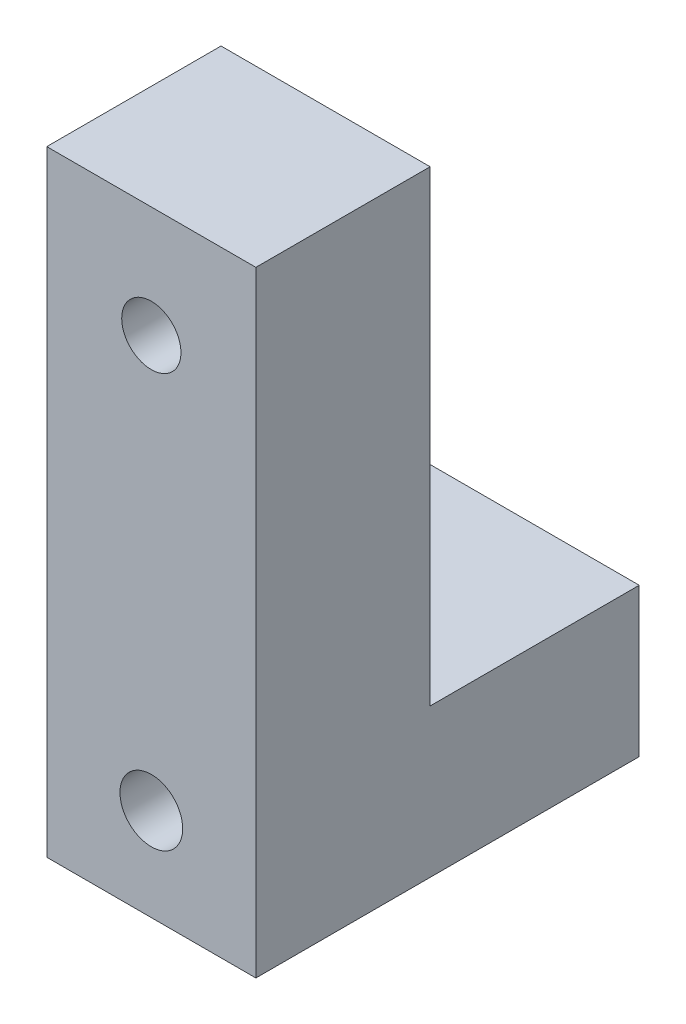
ISO-10303-21;
HEADER;
FILE_DESCRIPTION(('STEP AP214'),'2;1');
FILE_NAME('part.step','',(''),(''),'','','');
FILE_SCHEMA(('AUTOMOTIVE_DESIGN { 1 0 10303 214 1 1 1 1 }'));
ENDSEC;
DATA;
#1=APPLICATION_CONTEXT('core data for automotive mechanical design processes');
#2=APPLICATION_PROTOCOL_DEFINITION('international standard','automotive_design',2000,#1);
#3=PRODUCT_CONTEXT('',#1,'mechanical');
#4=PRODUCT('Part','Part','',(#3));
#5=PRODUCT_RELATED_PRODUCT_CATEGORY('part','',(#4));
#6=PRODUCT_DEFINITION_FORMATION('','',#4);
#7=PRODUCT_DEFINITION_CONTEXT('part definition',#1,'design');
#8=PRODUCT_DEFINITION('design','',#6,#7);
#9=PRODUCT_DEFINITION_SHAPE('','',#8);
#10=(LENGTH_UNIT() NAMED_UNIT(*) SI_UNIT(.MILLI.,.METRE.));
#11=(NAMED_UNIT(*) PLANE_ANGLE_UNIT() SI_UNIT($,.RADIAN.));
#12=(NAMED_UNIT(*) SI_UNIT($,.STERADIAN.) SOLID_ANGLE_UNIT());
#13=UNCERTAINTY_MEASURE_WITH_UNIT(LENGTH_MEASURE(1.E-05),#10,'distance_accuracy_value','');
#14=(GEOMETRIC_REPRESENTATION_CONTEXT(3) GLOBAL_UNCERTAINTY_ASSIGNED_CONTEXT((#13)) GLOBAL_UNIT_ASSIGNED_CONTEXT((#10,
#11,#12)) REPRESENTATION_CONTEXT('',''));
#15=CARTESIAN_POINT('',(0.,0.,0.));
#16=DIRECTION('',(0.,0.,1.));
#17=DIRECTION('',(1.,0.,0.));
#18=AXIS2_PLACEMENT_3D('',#15,#16,#17);
#19=CARTESIAN_POINT('',(15.,59.038200962956,73.5));
#20=DIRECTION('',(0.,0.,-1.));
#21=DIRECTION('',(-1.,0.,0.));
#22=AXIS2_PLACEMENT_3D('',#19,#20,#21);
#23=CYLINDRICAL_SURFACE('',#22,4.25);
#24=CARTESIAN_POINT('',(15.,59.038200962956,73.5));
#25=DIRECTION('',(0.,0.,-1.));
#26=DIRECTION('',(-1.,0.,0.));
#27=AXIS2_PLACEMENT_3D('',#24,#25,#26);
#28=CIRCLE('',#27,4.25);
#29=CARTESIAN_POINT('',(10.75,59.038200962956,73.5));
#30=VERTEX_POINT('',#29);
#31=EDGE_CURVE('E153',#30,#30,#28,.T.);
#32=ORIENTED_EDGE('',*,*,#31,.F.);
#33=EDGE_LOOP('',(#32));
#34=FACE_BOUND('',#33,.T.);
#35=CARTESIAN_POINT('',(15.,59.038200962956,56.5));
#36=DIRECTION('',(0.,0.,-1.));
#37=DIRECTION('',(-1.,0.,0.));
#38=AXIS2_PLACEMENT_3D('',#35,#36,#37);
#39=CIRCLE('',#38,4.25);
#40=CARTESIAN_POINT('',(10.75,59.038200962956,56.5));
#41=VERTEX_POINT('',#40);
#42=EDGE_CURVE('E41',#41,#41,#39,.F.);
#43=ORIENTED_EDGE('',*,*,#42,.F.);
#44=EDGE_LOOP('',(#43));
#45=FACE_BOUND('',#44,.T.);
#46=ADVANCED_FACE('F37',(#34,#45),#23,.F.);
#47=CARTESIAN_POINT('',(30.,8.00000000000004,48.5));
#48=DIRECTION('',(0.,-1.,0.));
#49=DIRECTION('',(0.,0.,-1.));
#50=AXIS2_PLACEMENT_3D('',#47,#48,#49);
#51=PLANE('',#50);
#52=DIRECTION('',(0.,0.,1.));
#53=VECTOR('',#52,1.);
#54=CARTESIAN_POINT('',(0.,8.00000000000004,48.5));
#55=LINE('',#54,#53);
#56=CARTESIAN_POINT('',(0.,8.00000000000004,18.5));
#57=VERTEX_POINT('',#56);
#58=CARTESIAN_POINT('',(0.,8.00000000000004,48.5));
#59=VERTEX_POINT('',#58);
#60=EDGE_CURVE('E123',#57,#59,#55,.T.);
#61=ORIENTED_EDGE('',*,*,#60,.T.);
#62=DIRECTION('',(-1.,0.,0.));
#63=VECTOR('',#62,1.);
#64=CARTESIAN_POINT('',(30.,8.00000000000004,48.5));
#65=LINE('',#64,#63);
#66=CARTESIAN_POINT('',(30.,8.00000000000004,48.5));
#67=VERTEX_POINT('',#66);
#68=EDGE_CURVE('E11',#67,#59,#65,.T.);
#69=ORIENTED_EDGE('',*,*,#68,.F.);
#70=DIRECTION('',(0.,0.,1.));
#71=VECTOR('',#70,1.);
#72=CARTESIAN_POINT('',(30.,8.00000000000004,48.5));
#73=LINE('',#72,#71);
#74=CARTESIAN_POINT('',(30.,8.00000000000004,18.5));
#75=VERTEX_POINT('',#74);
#76=EDGE_CURVE('E135',#75,#67,#73,.T.);
#77=ORIENTED_EDGE('',*,*,#76,.F.);
#78=DIRECTION('',(-1.,0.,0.));
#79=VECTOR('',#78,1.);
#80=CARTESIAN_POINT('',(30.,8.00000000000004,18.5));
#81=LINE('',#80,#79);
#82=EDGE_CURVE('E119',#75,#57,#81,.T.);
#83=ORIENTED_EDGE('',*,*,#82,.T.);
#84=EDGE_LOOP('',(#61,#69,#77,#83));
#85=FACE_BOUND('',#84,.T.);
#86=ADVANCED_FACE('F39',(#85),#51,.F.);
#87=CARTESIAN_POINT('',(30.,75.,48.5));
#88=DIRECTION('',(0.,0.,1.));
#89=DIRECTION('',(0.,-1.,0.));
#90=AXIS2_PLACEMENT_3D('',#87,#88,#89);
#91=PLANE('',#90);
#92=CARTESIAN_POINT('',(15.,59.038200962956,48.5));
#93=DIRECTION('',(0.,0.,-1.));
#94=DIRECTION('',(-1.,0.,0.));
#95=AXIS2_PLACEMENT_3D('',#92,#93,#94);
#96=CIRCLE('',#95,7.);
#97=CARTESIAN_POINT('',(8.,59.038200962956,48.5));
#98=VERTEX_POINT('',#97);
#99=EDGE_CURVE('E301',#98,#98,#96,.T.);
#100=ORIENTED_EDGE('',*,*,#99,.F.);
#101=EDGE_LOOP('',(#100));
#102=FACE_BOUND('',#101,.T.);
#103=DIRECTION('',(0.,1.,0.));
#104=VECTOR('',#103,1.);
#105=CARTESIAN_POINT('',(0.,75.,48.5));
#106=LINE('',#105,#104);
#107=CARTESIAN_POINT('',(0.,75.,48.5));
#108=VERTEX_POINT('',#107);
#109=EDGE_CURVE('E126',#59,#108,#106,.T.);
#110=ORIENTED_EDGE('',*,*,#109,.T.);
#111=DIRECTION('',(-1.,0.,0.));
#112=VECTOR('',#111,1.);
#113=CARTESIAN_POINT('',(30.,75.,48.5));
#114=LINE('',#113,#112);
#115=CARTESIAN_POINT('',(30.,75.,48.5));
#116=VERTEX_POINT('',#115);
#117=EDGE_CURVE('E47',#116,#108,#114,.T.);
#118=ORIENTED_EDGE('',*,*,#117,.F.);
#119=DIRECTION('',(0.,1.,0.));
#120=VECTOR('',#119,1.);
#121=CARTESIAN_POINT('',(30.,75.,48.5));
#122=LINE('',#121,#120);
#123=EDGE_CURVE('E93',#67,#116,#122,.T.);
#124=ORIENTED_EDGE('',*,*,#123,.F.);
#125=ORIENTED_EDGE('',*,*,#68,.T.);
#126=EDGE_LOOP('',(#110,#118,#124,#125));
#127=FACE_BOUND('',#126,.T.);
#128=ADVANCED_FACE('F161',(#102,#127),#91,.F.);
#129=CARTESIAN_POINT('',(30.,75.,48.5));
#130=DIRECTION('',(0.,-1.,0.));
#131=DIRECTION('',(0.,0.,-1.));
#132=AXIS2_PLACEMENT_3D('',#129,#130,#131);
#133=PLANE('',#132);
#134=DIRECTION('',(0.,0.,1.));
#135=VECTOR('',#134,1.);
#136=CARTESIAN_POINT('',(0.,75.,48.5));
#137=LINE('',#136,#135);
#138=CARTESIAN_POINT('',(0.,75.,73.5));
#139=VERTEX_POINT('',#138);
#140=EDGE_CURVE('E129',#108,#139,#137,.T.);
#141=ORIENTED_EDGE('',*,*,#140,.T.);
#142=DIRECTION('',(-1.,0.,0.));
#143=VECTOR('',#142,1.);
#144=CARTESIAN_POINT('',(30.,75.,73.5));
#145=LINE('',#144,#143);
#146=CARTESIAN_POINT('',(30.,75.,73.5));
#147=VERTEX_POINT('',#146);
#148=EDGE_CURVE('E114',#147,#139,#145,.T.);
#149=ORIENTED_EDGE('',*,*,#148,.F.);
#150=DIRECTION('',(0.,0.,1.));
#151=VECTOR('',#150,1.);
#152=CARTESIAN_POINT('',(30.,75.,48.5));
#153=LINE('',#152,#151);
#154=EDGE_CURVE('E106',#116,#147,#153,.T.);
#155=ORIENTED_EDGE('',*,*,#154,.F.);
#156=ORIENTED_EDGE('',*,*,#117,.T.);
#157=EDGE_LOOP('',(#141,#149,#155,#156));
#158=FACE_BOUND('',#157,.T.);
#159=ADVANCED_FACE('F164',(#158),#133,.F.);
#160=CARTESIAN_POINT('',(30.,8.00000000000004,73.5));
#161=DIRECTION('',(0.,0.,-1.));
#162=DIRECTION('',(-1.,0.,0.));
#163=AXIS2_PLACEMENT_3D('',#160,#161,#162);
#164=PLANE('',#163);
#165=ORIENTED_EDGE('',*,*,#31,.T.);
#166=EDGE_LOOP('',(#165));
#167=FACE_BOUND('',#166,.T.);
#168=CARTESIAN_POINT('',(15.,0.,73.5));
#169=DIRECTION('',(0.,0.,-1.));
#170=DIRECTION('',(0.,1.,0.));
#171=AXIS2_PLACEMENT_3D('',#168,#169,#170);
#172=CIRCLE('',#171,4.5);
#173=CARTESIAN_POINT('',(15.,4.49999999999999,73.5));
#174=VERTEX_POINT('',#173);
#175=EDGE_CURVE('E142',#174,#174,#172,.T.);
#176=ORIENTED_EDGE('',*,*,#175,.T.);
#177=EDGE_LOOP('',(#176));
#178=FACE_BOUND('',#177,.T.);
#179=DIRECTION('',(0.,-1.,0.));
#180=VECTOR('',#179,1.);
#181=CARTESIAN_POINT('',(0.,8.00000000000004,73.5));
#182=LINE('',#181,#180);
#183=CARTESIAN_POINT('',(0.,-13.3,73.5));
#184=VERTEX_POINT('',#183);
#185=EDGE_CURVE('E113',#139,#184,#182,.T.);
#186=ORIENTED_EDGE('',*,*,#185,.T.);
#187=DIRECTION('',(-1.,0.,0.));
#188=VECTOR('',#187,1.);
#189=CARTESIAN_POINT('',(30.,-13.3,73.5));
#190=LINE('',#189,#188);
#191=CARTESIAN_POINT('',(30.,-13.3,73.5));
#192=VERTEX_POINT('',#191);
#193=EDGE_CURVE('E111',#192,#184,#190,.T.);
#194=ORIENTED_EDGE('',*,*,#193,.F.);
#195=DIRECTION('',(0.,-1.,0.));
#196=VECTOR('',#195,1.);
#197=CARTESIAN_POINT('',(30.,75.,73.5));
#198=LINE('',#197,#196);
#199=EDGE_CURVE('E100',#147,#192,#198,.T.);
#200=ORIENTED_EDGE('',*,*,#199,.F.);
#201=ORIENTED_EDGE('',*,*,#148,.T.);
#202=EDGE_LOOP('',(#186,#194,#200,#201));
#203=FACE_BOUND('',#202,.T.);
#204=ADVANCED_FACE('F112',(#167,#178,#203),#164,.F.);
#205=CARTESIAN_POINT('',(30.,-13.3,18.5));
#206=DIRECTION('',(0.,1.,0.));
#207=DIRECTION('',(0.,0.,1.));
#208=AXIS2_PLACEMENT_3D('',#205,#206,#207);
#209=PLANE('',#208);
#210=DIRECTION('',(0.,0.,-1.));
#211=VECTOR('',#210,1.);
#212=CARTESIAN_POINT('',(0.,-13.3,18.5));
#213=LINE('',#212,#211);
#214=CARTESIAN_POINT('',(0.,-13.3,18.5));
#215=VERTEX_POINT('',#214);
#216=EDGE_CURVE('E79',#184,#215,#213,.T.);
#217=ORIENTED_EDGE('',*,*,#216,.T.);
#218=DIRECTION('',(-1.,0.,0.));
#219=VECTOR('',#218,1.);
#220=CARTESIAN_POINT('',(30.,-13.3,18.5));
#221=LINE('',#220,#219);
#222=CARTESIAN_POINT('',(30.,-13.3,18.5));
#223=VERTEX_POINT('',#222);
#224=EDGE_CURVE('E115',#223,#215,#221,.T.);
#225=ORIENTED_EDGE('',*,*,#224,.F.);
#226=DIRECTION('',(0.,0.,-1.));
#227=VECTOR('',#226,1.);
#228=CARTESIAN_POINT('',(30.,-13.3,18.5));
#229=LINE('',#228,#227);
#230=EDGE_CURVE('E104',#192,#223,#229,.T.);
#231=ORIENTED_EDGE('',*,*,#230,.F.);
#232=ORIENTED_EDGE('',*,*,#193,.T.);
#233=EDGE_LOOP('',(#217,#225,#231,#232));
#234=FACE_BOUND('',#233,.T.);
#235=ADVANCED_FACE('F117',(#234),#209,.F.);
#236=CARTESIAN_POINT('',(30.,8.00000000000004,18.5));
#237=DIRECTION('',(0.,0.,1.));
#238=DIRECTION('',(0.,-1.,0.));
#239=AXIS2_PLACEMENT_3D('',#236,#237,#238);
#240=PLANE('',#239);
#241=CARTESIAN_POINT('',(15.,0.,18.5));
#242=DIRECTION('',(0.,0.,-1.));
#243=DIRECTION('',(0.,1.,0.));
#244=AXIS2_PLACEMENT_3D('',#241,#242,#243);
#245=CIRCLE('',#244,2.65);
#246=CARTESIAN_POINT('',(15.,2.65,18.5));
#247=VERTEX_POINT('',#246);
#248=EDGE_CURVE('E127',#247,#247,#245,.T.);
#249=ORIENTED_EDGE('',*,*,#248,.F.);
#250=EDGE_LOOP('',(#249));
#251=FACE_BOUND('',#250,.T.);
#252=DIRECTION('',(0.,1.,0.));
#253=VECTOR('',#252,1.);
#254=CARTESIAN_POINT('',(0.,8.00000000000004,18.5));
#255=LINE('',#254,#253);
#256=EDGE_CURVE('E85',#215,#57,#255,.T.);
#257=ORIENTED_EDGE('',*,*,#256,.T.);
#258=ORIENTED_EDGE('',*,*,#82,.F.);
#259=DIRECTION('',(0.,1.,0.));
#260=VECTOR('',#259,1.);
#261=CARTESIAN_POINT('',(30.,8.00000000000004,18.5));
#262=LINE('',#261,#260);
#263=EDGE_CURVE('E56',#223,#75,#262,.T.);
#264=ORIENTED_EDGE('',*,*,#263,.F.);
#265=ORIENTED_EDGE('',*,*,#224,.T.);
#266=EDGE_LOOP('',(#257,#258,#264,#265));
#267=FACE_BOUND('',#266,.T.);
#268=ADVANCED_FACE('F169',(#251,#267),#240,.F.);
#269=CARTESIAN_POINT('',(30.,0.,0.));
#270=DIRECTION('',(-1.,0.,0.));
#271=DIRECTION('',(0.,0.,1.));
#272=AXIS2_PLACEMENT_3D('',#269,#270,#271);
#273=PLANE('',#272);
#274=ORIENTED_EDGE('',*,*,#76,.T.);
#275=ORIENTED_EDGE('',*,*,#123,.T.);
#276=ORIENTED_EDGE('',*,*,#154,.T.);
#277=ORIENTED_EDGE('',*,*,#199,.T.);
#278=ORIENTED_EDGE('',*,*,#230,.T.);
#279=ORIENTED_EDGE('',*,*,#263,.T.);
#280=EDGE_LOOP('',(#274,#275,#276,#277,#278,#279));
#281=FACE_BOUND('',#280,.T.);
#282=ADVANCED_FACE('F102',(#281),#273,.F.);
#283=CARTESIAN_POINT('',(0.,0.,0.));
#284=DIRECTION('',(-1.,0.,0.));
#285=DIRECTION('',(0.,0.,1.));
#286=AXIS2_PLACEMENT_3D('',#283,#284,#285);
#287=PLANE('',#286);
#288=ORIENTED_EDGE('',*,*,#60,.F.);
#289=ORIENTED_EDGE('',*,*,#256,.F.);
#290=ORIENTED_EDGE('',*,*,#216,.F.);
#291=ORIENTED_EDGE('',*,*,#185,.F.);
#292=ORIENTED_EDGE('',*,*,#140,.F.);
#293=ORIENTED_EDGE('',*,*,#109,.F.);
#294=EDGE_LOOP('',(#288,#289,#290,#291,#292,#293));
#295=FACE_BOUND('',#294,.T.);
#296=ADVANCED_FACE('F167',(#295),#287,.T.);
#297=CARTESIAN_POINT('',(15.,0.,73.5));
#298=DIRECTION('',(0.,0.,-1.));
#299=DIRECTION('',(0.,1.,0.));
#300=AXIS2_PLACEMENT_3D('',#297,#298,#299);
#301=CYLINDRICAL_SURFACE('',#300,2.65);
#302=CARTESIAN_POINT('',(15.,0.,32.5));
#303=DIRECTION('',(0.,0.,-1.));
#304=DIRECTION('',(0.,1.,0.));
#305=AXIS2_PLACEMENT_3D('',#302,#303,#304);
#306=CIRCLE('',#305,2.65);
#307=CARTESIAN_POINT('',(15.,2.65,32.5));
#308=VERTEX_POINT('',#307);
#309=EDGE_CURVE('E140',#308,#308,#306,.F.);
#310=ORIENTED_EDGE('',*,*,#309,.T.);
#311=EDGE_LOOP('',(#310));
#312=FACE_BOUND('',#311,.T.);
#313=ORIENTED_EDGE('',*,*,#248,.T.);
#314=EDGE_LOOP('',(#313));
#315=FACE_BOUND('',#314,.T.);
#316=ADVANCED_FACE('F197',(#312,#315),#301,.F.);
#317=CARTESIAN_POINT('',(15.,0.,32.5));
#318=DIRECTION('',(0.,0.,-1.));
#319=DIRECTION('',(0.,1.,0.));
#320=AXIS2_PLACEMENT_3D('',#317,#318,#319);
#321=PLANE('',#320);
#322=CARTESIAN_POINT('',(15.,0.,32.5));
#323=DIRECTION('',(0.,0.,-1.));
#324=DIRECTION('',(0.,1.,0.));
#325=AXIS2_PLACEMENT_3D('',#322,#323,#324);
#326=CIRCLE('',#325,4.5);
#327=CARTESIAN_POINT('',(15.,4.5,32.5));
#328=VERTEX_POINT('',#327);
#329=EDGE_CURVE('E148',#328,#328,#326,.T.);
#330=ORIENTED_EDGE('',*,*,#329,.F.);
#331=EDGE_LOOP('',(#330));
#332=FACE_BOUND('',#331,.T.);
#333=ORIENTED_EDGE('',*,*,#309,.F.);
#334=EDGE_LOOP('',(#333));
#335=FACE_BOUND('',#334,.T.);
#336=ADVANCED_FACE('F193',(#332,#335),#321,.F.);
#337=CARTESIAN_POINT('',(15.,0.,73.5));
#338=DIRECTION('',(0.,0.,-1.));
#339=DIRECTION('',(0.,1.,0.));
#340=AXIS2_PLACEMENT_3D('',#337,#338,#339);
#341=CYLINDRICAL_SURFACE('',#340,4.5);
#342=ORIENTED_EDGE('',*,*,#175,.F.);
#343=EDGE_LOOP('',(#342));
#344=FACE_BOUND('',#343,.T.);
#345=ORIENTED_EDGE('',*,*,#329,.T.);
#346=EDGE_LOOP('',(#345));
#347=FACE_BOUND('',#346,.T.);
#348=ADVANCED_FACE('F196',(#344,#347),#341,.F.);
#349=CARTESIAN_POINT('',(15.,59.038200962956,56.5));
#350=DIRECTION('',(0.,0.,-1.));
#351=DIRECTION('',(-1.,0.,0.));
#352=AXIS2_PLACEMENT_3D('',#349,#350,#351);
#353=PLANE('',#352);
#354=CARTESIAN_POINT('',(15.,59.038200962956,56.5));
#355=DIRECTION('',(0.,0.,-1.));
#356=DIRECTION('',(-1.,0.,0.));
#357=AXIS2_PLACEMENT_3D('',#354,#355,#356);
#358=CIRCLE('',#357,7.);
#359=CARTESIAN_POINT('',(8.,59.038200962956,56.5));
#360=VERTEX_POINT('',#359);
#361=EDGE_CURVE('E303',#360,#360,#358,.T.);
#362=ORIENTED_EDGE('',*,*,#361,.T.);
#363=EDGE_LOOP('',(#362));
#364=FACE_BOUND('',#363,.T.);
#365=ORIENTED_EDGE('',*,*,#42,.T.);
#366=EDGE_LOOP('',(#365));
#367=FACE_BOUND('',#366,.T.);
#368=ADVANCED_FACE('F201',(#364,#367),#353,.T.);
#369=CARTESIAN_POINT('',(15.,59.038200962956,56.5));
#370=DIRECTION('',(0.,0.,-1.));
#371=DIRECTION('',(-1.,0.,0.));
#372=AXIS2_PLACEMENT_3D('',#369,#370,#371);
#373=CYLINDRICAL_SURFACE('',#372,7.);
#374=ORIENTED_EDGE('',*,*,#361,.F.);
#375=EDGE_LOOP('',(#374));
#376=FACE_BOUND('',#375,.T.);
#377=ORIENTED_EDGE('',*,*,#99,.T.);
#378=EDGE_LOOP('',(#377));
#379=FACE_BOUND('',#378,.T.);
#380=ADVANCED_FACE('F191',(#376,#379),#373,.F.);
#381=CLOSED_SHELL('',(#46,#86,#128,#159,#204,#235,#268,#282,#296,#316,#336,#348,#368,#380));
#382=MANIFOLD_SOLID_BREP('B2',#381);
#383=ADVANCED_BREP_SHAPE_REPRESENTATION('',(#18,#382),#14);
#384=SHAPE_DEFINITION_REPRESENTATION(#9,#383);
ENDSEC;
END-ISO-10303-21;
